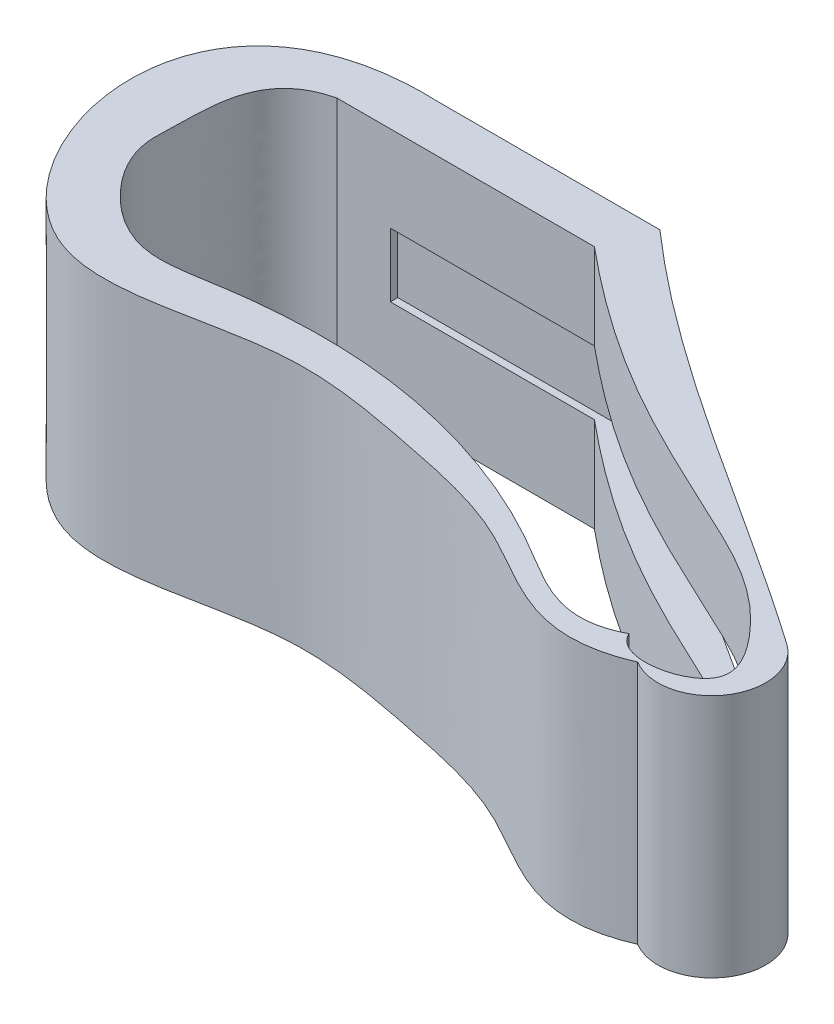
ISO-10303-21;
HEADER;
FILE_DESCRIPTION(('STEP AP214'),'2;1');
FILE_NAME('part.step','',(''),(''),'','','');
FILE_SCHEMA(('AUTOMOTIVE_DESIGN { 1 0 10303 214 1 1 1 1 }'));
ENDSEC;
DATA;
#1=APPLICATION_CONTEXT('core data for automotive mechanical design processes');
#2=APPLICATION_PROTOCOL_DEFINITION('international standard','automotive_design',2000,#1);
#3=PRODUCT_CONTEXT('',#1,'mechanical');
#4=PRODUCT('Part','Part','',(#3));
#5=PRODUCT_RELATED_PRODUCT_CATEGORY('part','',(#4));
#6=PRODUCT_DEFINITION_FORMATION('','',#4);
#7=PRODUCT_DEFINITION_CONTEXT('part definition',#1,'design');
#8=PRODUCT_DEFINITION('design','',#6,#7);
#9=PRODUCT_DEFINITION_SHAPE('','',#8);
#10=(LENGTH_UNIT() NAMED_UNIT(*) SI_UNIT(.MILLI.,.METRE.));
#11=(NAMED_UNIT(*) PLANE_ANGLE_UNIT() SI_UNIT($,.RADIAN.));
#12=(NAMED_UNIT(*) SI_UNIT($,.STERADIAN.) SOLID_ANGLE_UNIT());
#13=UNCERTAINTY_MEASURE_WITH_UNIT(LENGTH_MEASURE(1.E-05),#10,'distance_accuracy_value','');
#14=(GEOMETRIC_REPRESENTATION_CONTEXT(3) GLOBAL_UNCERTAINTY_ASSIGNED_CONTEXT((#13)) GLOBAL_UNIT_ASSIGNED_CONTEXT((#10,
#11,#12)) REPRESENTATION_CONTEXT('',''));
#15=CARTESIAN_POINT('',(0.,0.,0.));
#16=DIRECTION('',(0.,0.,1.));
#17=DIRECTION('',(1.,0.,0.));
#18=AXIS2_PLACEMENT_3D('',#15,#16,#17);
#19=CARTESIAN_POINT('',(50.,55.,0.));
#20=CARTESIAN_POINT('',(79.0245250397577,55.,25.5134937849484));
#21=CARTESIAN_POINT('',(113.333333333333,55.,44.2982456140352));
#22=CARTESIAN_POINT('',(145.,55.,66.4473684210526));
#23=B_SPLINE_CURVE_WITH_KNOTS('',3,(#19,#20,#21,#22),.UNSPECIFIED.,.F.,.F.,(4,4),(0.,1.),.UNSPECIFIED.);
#24=DIRECTION('',(0.,-1.,0.));
#25=VECTOR('',#24,1.);
#26=SURFACE_OF_LINEAR_EXTRUSION('',#23,#25);
#27=CARTESIAN_POINT('',(50.,0.,0.));
#28=CARTESIAN_POINT('',(79.0245250397577,0.,25.5134937849484));
#29=CARTESIAN_POINT('',(113.333333333333,0.,44.2982456140352));
#30=CARTESIAN_POINT('',(145.,0.,66.4473684210526));
#31=B_SPLINE_CURVE_WITH_KNOTS('',3,(#27,#28,#29,#30),.UNSPECIFIED.,.F.,.F.,(4,4),(0.,1.),.UNSPECIFIED.);
#32=CARTESIAN_POINT('',(50.,0.,0.));
#33=VERTEX_POINT('',#32);
#34=CARTESIAN_POINT('',(145.,0.,66.4473684210526));
#35=VERTEX_POINT('',#34);
#36=EDGE_CURVE('E300',#33,#35,#31,.T.);
#37=ORIENTED_EDGE('',*,*,#36,.F.);
#38=DIRECTION('',(0.,-1.,0.));
#39=VECTOR('',#38,1.);
#40=CARTESIAN_POINT('',(50.,55.,0.));
#41=LINE('',#40,#39);
#42=CARTESIAN_POINT('',(50.,55.,0.));
#43=VERTEX_POINT('',#42);
#44=EDGE_CURVE('E317',#43,#33,#41,.T.);
#45=ORIENTED_EDGE('',*,*,#44,.F.);
#46=CARTESIAN_POINT('',(145.,55.,66.4473684210526));
#47=VERTEX_POINT('',#46);
#48=EDGE_CURVE('E273',#43,#47,#23,.T.);
#49=ORIENTED_EDGE('',*,*,#48,.T.);
#50=DIRECTION('',(0.,-1.,0.));
#51=VECTOR('',#50,1.);
#52=CARTESIAN_POINT('',(145.,55.,66.4473684210526));
#53=LINE('',#52,#51);
#54=EDGE_CURVE('E315',#47,#35,#53,.T.);
#55=ORIENTED_EDGE('',*,*,#54,.T.);
#56=EDGE_LOOP('',(#37,#45,#49,#55));
#57=FACE_BOUND('',#56,.T.);
#58=CARTESIAN_POINT('',(50.,21.2909884969934,0.));
#59=CARTESIAN_POINT('',(79.0245250397577,21.2909884969934,25.5134937849484));
#60=CARTESIAN_POINT('',(113.333333333333,21.2909884969934,44.2982456140352));
#61=CARTESIAN_POINT('',(145.,21.2909884969934,66.4473684210526));
#62=B_SPLINE_CURVE_WITH_KNOTS('',3,(#58,#59,#60,#61),.UNSPECIFIED.,.F.,.F.,(4,4),(0.,1.),.UNSPECIFIED.);
#63=CARTESIAN_POINT('',(60.7614289056083,21.2909884969934,8.98967668737785));
#64=VERTEX_POINT('',#63);
#65=CARTESIAN_POINT('',(140.103841498925,21.2909884969934,63.0618556033218));
#66=VERTEX_POINT('',#65);
#67=EDGE_CURVE('E206',#64,#66,#62,.T.);
#68=ORIENTED_EDGE('',*,*,#67,.T.);
#69=DIRECTION('',(0.,-1.,0.));
#70=VECTOR('',#69,1.);
#71=CARTESIAN_POINT('',(140.103841498925,55.,63.0618556033217));
#72=LINE('',#71,#70);
#73=CARTESIAN_POINT('',(140.103841498925,35.664605677181,63.0618556033218));
#74=VERTEX_POINT('',#73);
#75=EDGE_CURVE('E218',#66,#74,#72,.F.);
#76=ORIENTED_EDGE('',*,*,#75,.T.);
#77=CARTESIAN_POINT('',(50.,35.664605677181,0.));
#78=CARTESIAN_POINT('',(79.0245250397577,35.664605677181,25.5134937849484));
#79=CARTESIAN_POINT('',(113.333333333333,35.664605677181,44.2982456140352));
#80=CARTESIAN_POINT('',(145.,35.664605677181,66.4473684210526));
#81=B_SPLINE_CURVE_WITH_KNOTS('',3,(#77,#78,#79,#80),.UNSPECIFIED.,.F.,.F.,(4,4),(0.,1.),.UNSPECIFIED.);
#82=CARTESIAN_POINT('',(60.7614289059177,35.664605677181,8.98967668762419));
#83=VERTEX_POINT('',#82);
#84=EDGE_CURVE('E190',#83,#74,#81,.T.);
#85=ORIENTED_EDGE('',*,*,#84,.F.);
#86=DIRECTION('',(0.,-1.,0.));
#87=VECTOR('',#86,1.);
#88=CARTESIAN_POINT('',(60.7614289056083,55.,8.98967668737785));
#89=LINE('',#88,#87);
#90=EDGE_CURVE('E11',#64,#83,#89,.F.);
#91=ORIENTED_EDGE('',*,*,#90,.F.);
#92=EDGE_LOOP('',(#68,#76,#85,#91));
#93=FACE_BOUND('',#92,.T.);
#94=ADVANCED_FACE('F37',(#57,#93),#26,.T.);
#95=CARTESIAN_POINT('',(45.9198185661056,69.,10.6538645582966));
#96=DIRECTION('',(0.,0.,1.));
#97=DIRECTION('',(1.,0.,0.));
#98=AXIS2_PLACEMENT_3D('',#95,#96,#97);
#99=PLANE('',#98);
#100=DIRECTION('',(0.,-1.,0.));
#101=VECTOR('',#100,1.);
#102=CARTESIAN_POINT('',(45.9198185661055,69.,10.6538645582966));
#103=LINE('',#102,#101);
#104=CARTESIAN_POINT('',(45.9198185661055,21.2909884969934,10.6538645582966));
#105=VERTEX_POINT('',#104);
#106=CARTESIAN_POINT('',(45.9198185661055,0.,10.6538645582966));
#107=VERTEX_POINT('',#106);
#108=EDGE_CURVE('E376',#105,#107,#103,.T.);
#109=ORIENTED_EDGE('',*,*,#108,.F.);
#110=DIRECTION('',(-1.,0.,0.));
#111=VECTOR('',#110,1.);
#112=CARTESIAN_POINT('',(45.9198185661056,21.2909884969934,10.6538645582966));
#113=LINE('',#112,#111);
#114=CARTESIAN_POINT('',(0.,21.2909884969934,10.6538645582966));
#115=VERTEX_POINT('',#114);
#116=EDGE_CURVE('E197',#105,#115,#113,.T.);
#117=ORIENTED_EDGE('',*,*,#116,.T.);
#118=DIRECTION('',(0.,1.,0.));
#119=VECTOR('',#118,1.);
#120=CARTESIAN_POINT('',(0.,69.,10.6538645582966));
#121=LINE('',#120,#119);
#122=CARTESIAN_POINT('',(0.,35.664605677181,10.6538645582966));
#123=VERTEX_POINT('',#122);
#124=EDGE_CURVE('E221',#115,#123,#121,.T.);
#125=ORIENTED_EDGE('',*,*,#124,.T.);
#126=DIRECTION('',(-1.,0.,0.));
#127=VECTOR('',#126,1.);
#128=CARTESIAN_POINT('',(45.9198185661056,35.664605677181,10.6538645582966));
#129=LINE('',#128,#127);
#130=CARTESIAN_POINT('',(45.9198185661055,35.664605677181,10.6538645582966));
#131=VERTEX_POINT('',#130);
#132=EDGE_CURVE('E184',#131,#123,#129,.T.);
#133=ORIENTED_EDGE('',*,*,#132,.F.);
#134=CARTESIAN_POINT('',(45.9198185661055,55.,10.6538645582966));
#135=VERTEX_POINT('',#134);
#136=EDGE_CURVE('E381',#135,#131,#103,.T.);
#137=ORIENTED_EDGE('',*,*,#136,.F.);
#138=DIRECTION('',(1.,0.,0.));
#139=VECTOR('',#138,1.);
#140=CARTESIAN_POINT('',(11.8218182295419,55.,10.6538645582966));
#141=LINE('',#140,#139);
#142=CARTESIAN_POINT('',(-11.9907204871083,55.,10.6538645582966));
#143=VERTEX_POINT('',#142);
#144=EDGE_CURVE('E408',#143,#135,#141,.T.);
#145=ORIENTED_EDGE('',*,*,#144,.F.);
#146=DIRECTION('',(0.,-1.,0.));
#147=VECTOR('',#146,1.);
#148=CARTESIAN_POINT('',(-11.9907204871083,69.,10.6538645582966));
#149=LINE('',#148,#147);
#150=CARTESIAN_POINT('',(-11.9907204871083,0.,10.6538645582966));
#151=VERTEX_POINT('',#150);
#152=EDGE_CURVE('E393',#143,#151,#149,.T.);
#153=ORIENTED_EDGE('',*,*,#152,.T.);
#154=DIRECTION('',(-1.,0.,0.));
#155=VECTOR('',#154,1.);
#156=CARTESIAN_POINT('',(45.9198185661056,0.,10.6538645582966));
#157=LINE('',#156,#155);
#158=EDGE_CURVE('E224',#107,#151,#157,.T.);
#159=ORIENTED_EDGE('',*,*,#158,.F.);
#160=EDGE_LOOP('',(#109,#117,#125,#133,#137,#145,#153,#159));
#161=FACE_BOUND('',#160,.T.);
#162=ADVANCED_FACE('F242',(#161),#99,.T.);
#163=CARTESIAN_POINT('',(-11.9907204871083,69.,10.6538645582966));
#164=CARTESIAN_POINT('',(-25.5960362402036,69.,13.8285071600395));
#165=CARTESIAN_POINT('',(-24.3693839179613,69.,27.6016775792646));
#166=CARTESIAN_POINT('',(-25.2041759688814,69.,43.5785634961515));
#167=CARTESIAN_POINT('',(-18.7717193506333,69.,54.4057587948836));
#168=CARTESIAN_POINT('',(-4.93842136242372,69.,63.6852957654707));
#169=CARTESIAN_POINT('',(16.8652741272833,69.,59.0849539313403));
#170=CARTESIAN_POINT('',(51.5892244408212,69.,57.3074758300545));
#171=CARTESIAN_POINT('',(90.5076644723297,69.,70.0717768823995));
#172=CARTESIAN_POINT('',(114.302121813737,69.,87.8333682441384));
#173=CARTESIAN_POINT('',(125.220110653523,69.,82.18080296494));
#174=B_SPLINE_CURVE_WITH_KNOTS('',3,(#163,#164,#165,#166,#167,#168,#169,#170,#171,#172,#173),
.UNSPECIFIED.,.F.,.F.,(4,1,1,1,1,1,1,1,4),(0.,0.142783015573018,0.159264519642799,
0.237664021420667,0.319036310464675,0.395894994651881,0.562922971471731,0.851387632545439,1.),.UNSPECIFIED.);
#175=DIRECTION('',(0.,-1.,0.));
#176=VECTOR('',#175,1.);
#177=SURFACE_OF_LINEAR_EXTRUSION('',#174,#176);
#178=DIRECTION('',(0.,-1.,0.));
#179=VECTOR('',#178,1.);
#180=CARTESIAN_POINT('',(125.220110653523,69.,82.18080296494));
#181=LINE('',#180,#179);
#182=CARTESIAN_POINT('',(125.220110653523,55.,82.1808029649401));
#183=VERTEX_POINT('',#182);
#184=CARTESIAN_POINT('',(125.220110653523,0.,82.18080296494));
#185=VERTEX_POINT('',#184);
#186=EDGE_CURVE('E385',#183,#185,#181,.T.);
#187=ORIENTED_EDGE('',*,*,#186,.T.);
#188=CARTESIAN_POINT('',(-11.9907204871083,0.,10.6538645582966));
#189=CARTESIAN_POINT('',(-25.5960362402036,0.,13.8285071600395));
#190=CARTESIAN_POINT('',(-24.3693839179613,0.,27.6016775792646));
#191=CARTESIAN_POINT('',(-25.2041759688814,0.,43.5785634961515));
#192=CARTESIAN_POINT('',(-18.7717193506333,0.,54.4057587948836));
#193=CARTESIAN_POINT('',(-4.93842136242372,0.,63.6852957654707));
#194=CARTESIAN_POINT('',(16.8652741272833,0.,59.0849539313403));
#195=CARTESIAN_POINT('',(51.5892244408212,0.,57.3074758300545));
#196=CARTESIAN_POINT('',(90.5076644723297,0.,70.0717768823995));
#197=CARTESIAN_POINT('',(114.302121813737,0.,87.8333682441384));
#198=CARTESIAN_POINT('',(125.220110653523,0.,82.18080296494));
#199=B_SPLINE_CURVE_WITH_KNOTS('',3,(#188,#189,#190,#191,#192,#193,#194,#195,#196,#197,#198),
.UNSPECIFIED.,.F.,.F.,(4,1,1,1,1,1,1,1,4),(0.,0.142783015573018,0.159264519642799,
0.237664021420667,0.319036310464675,0.395894994651881,0.562922971471731,0.851387632545439,1.),.UNSPECIFIED.);
#200=EDGE_CURVE('E386',#151,#185,#199,.T.);
#201=ORIENTED_EDGE('',*,*,#200,.F.);
#202=ORIENTED_EDGE('',*,*,#152,.F.);
#203=CARTESIAN_POINT('',(-11.9907204871083,55.,10.6538645582966));
#204=CARTESIAN_POINT('',(-25.5960362402036,55.,13.8285071600395));
#205=CARTESIAN_POINT('',(-24.3693839179613,55.,27.6016775792646));
#206=CARTESIAN_POINT('',(-25.2041759688814,55.,43.5785634961515));
#207=CARTESIAN_POINT('',(-18.7717193506333,55.,54.4057587948836));
#208=CARTESIAN_POINT('',(-4.93842136242372,55.,63.6852957654707));
#209=CARTESIAN_POINT('',(16.8652741272833,55.,59.0849539313403));
#210=CARTESIAN_POINT('',(51.5892244408212,55.,57.3074758300545));
#211=CARTESIAN_POINT('',(90.5076644723297,55.,70.0717768823995));
#212=CARTESIAN_POINT('',(114.302121813737,55.,87.8333682441384));
#213=CARTESIAN_POINT('',(125.220110653523,55.,82.18080296494));
#214=B_SPLINE_CURVE_WITH_KNOTS('',3,(#203,#204,#205,#206,#207,#208,#209,#210,#211,#212,#213),
.UNSPECIFIED.,.F.,.F.,(4,1,1,1,1,1,1,1,4),(0.,0.142783015573018,0.159264519642799,
0.237664021420667,0.319036310464675,0.395894994651881,0.562922971471731,0.851387632545439,1.),.UNSPECIFIED.);
#215=EDGE_CURVE('E400',#183,#143,#214,.F.);
#216=ORIENTED_EDGE('',*,*,#215,.F.);
#217=EDGE_LOOP('',(#187,#201,#202,#216));
#218=FACE_BOUND('',#217,.T.);
#219=CARTESIAN_POINT('',(-11.9907204871083,21.2909884969934,10.6538645582966));
#220=CARTESIAN_POINT('',(-25.5960362402036,21.2909884969934,13.8285071600395));
#221=CARTESIAN_POINT('',(-24.3693839179613,21.2909884969934,27.6016775792646));
#222=CARTESIAN_POINT('',(-25.2041759688814,21.2909884969934,43.5785634961515));
#223=CARTESIAN_POINT('',(-18.7717193506333,21.2909884969934,54.4057587948836));
#224=CARTESIAN_POINT('',(-4.93842136242372,21.2909884969934,63.6852957654707));
#225=CARTESIAN_POINT('',(16.8652741272833,21.2909884969934,59.0849539313403));
#226=CARTESIAN_POINT('',(51.5892244408212,21.2909884969934,57.3074758300545));
#227=CARTESIAN_POINT('',(90.5076644723297,21.2909884969934,70.0717768823995));
#228=CARTESIAN_POINT('',(114.302121813737,21.2909884969934,87.8333682441384));
#229=CARTESIAN_POINT('',(125.220110653523,21.2909884969934,82.18080296494));
#230=B_SPLINE_CURVE_WITH_KNOTS('',3,(#219,#220,#221,#222,#223,#224,#225,#226,#227,#228,#229),
.UNSPECIFIED.,.F.,.F.,(4,1,1,1,1,1,1,1,4),(0.,0.142783015573018,0.159264519642799,
0.237664021420667,0.319036310464675,0.395894994651881,0.562922971471731,0.851387632545439,1.),.UNSPECIFIED.);
#231=CARTESIAN_POINT('',(0.,21.2909884969934,61.9686026511814));
#232=VERTEX_POINT('',#231);
#233=CARTESIAN_POINT('',(65.1939779967523,21.2909884969934,63.0618556033218));
#234=VERTEX_POINT('',#233);
#235=EDGE_CURVE('E164',#232,#234,#230,.T.);
#236=ORIENTED_EDGE('',*,*,#235,.T.);
#237=DIRECTION('',(0.,-1.,0.));
#238=VECTOR('',#237,1.);
#239=CARTESIAN_POINT('',(65.1939779983709,27.5,63.0618556033218));
#240=LINE('',#239,#238);
#241=CARTESIAN_POINT('',(65.1939779967523,35.664605677181,63.0618556033218));
#242=VERTEX_POINT('',#241);
#243=EDGE_CURVE('E157',#234,#242,#240,.F.);
#244=ORIENTED_EDGE('',*,*,#243,.T.);
#245=CARTESIAN_POINT('',(-11.9907204871083,35.664605677181,10.6538645582966));
#246=CARTESIAN_POINT('',(-25.5960362402036,35.664605677181,13.8285071600395));
#247=CARTESIAN_POINT('',(-24.3693839179613,35.664605677181,27.6016775792646));
#248=CARTESIAN_POINT('',(-25.2041759688814,35.664605677181,43.5785634961515));
#249=CARTESIAN_POINT('',(-18.7717193506333,35.664605677181,54.4057587948836));
#250=CARTESIAN_POINT('',(-4.93842136242372,35.664605677181,63.6852957654707));
#251=CARTESIAN_POINT('',(16.8652741272833,35.664605677181,59.0849539313403));
#252=CARTESIAN_POINT('',(51.5892244408212,35.664605677181,57.3074758300545));
#253=CARTESIAN_POINT('',(90.5076644723297,35.664605677181,70.0717768823995));
#254=CARTESIAN_POINT('',(114.302121813737,35.664605677181,87.8333682441384));
#255=CARTESIAN_POINT('',(125.220110653523,35.664605677181,82.18080296494));
#256=B_SPLINE_CURVE_WITH_KNOTS('',3,(#245,#246,#247,#248,#249,#250,#251,#252,#253,#254,#255),
.UNSPECIFIED.,.F.,.F.,(4,1,1,1,1,1,1,1,4),(0.,0.142783015573018,0.159264519642799,
0.237664021420667,0.319036310464675,0.395894994651881,0.562922971471731,0.851387632545439,1.),.UNSPECIFIED.);
#257=CARTESIAN_POINT('',(0.,35.664605677181,61.9686026511814));
#258=VERTEX_POINT('',#257);
#259=EDGE_CURVE('E186',#258,#242,#256,.T.);
#260=ORIENTED_EDGE('',*,*,#259,.F.);
#261=DIRECTION('',(0.,-1.,0.));
#262=VECTOR('',#261,1.);
#263=CARTESIAN_POINT('',(0.,27.5,61.9686026511814));
#264=LINE('',#263,#262);
#265=EDGE_CURVE('E46',#258,#232,#264,.T.);
#266=ORIENTED_EDGE('',*,*,#265,.T.);
#267=EDGE_LOOP('',(#236,#244,#260,#266));
#268=FACE_BOUND('',#267,.T.);
#269=ADVANCED_FACE('F237',(#218,#268),#177,.T.);
#270=CARTESIAN_POINT('',(125.220110653523,69.,82.1808029649401));
#271=CARTESIAN_POINT('',(128.040973737857,69.,88.5495349270681));
#272=CARTESIAN_POINT('',(149.853952228594,69.,84.3702021922585));
#273=CARTESIAN_POINT('',(134.936663636845,69.,61.4112863937901));
#274=CARTESIAN_POINT('',(98.3416588067694,69.,43.7118445451393));
#275=CARTESIAN_POINT('',(72.4382320146535,69.,32.6536957633852));
#276=CARTESIAN_POINT('',(45.9198185661055,69.,10.6538645582966));
#277=B_SPLINE_CURVE_WITH_KNOTS('',3,(#270,#271,#272,#273,#274,#275,#276),.UNSPECIFIED.,.F.,.F.,
(4,1,1,1,4),(0.,0.144149385265527,0.22952118101207,0.450932314239249,1.),.UNSPECIFIED.);
#278=DIRECTION('',(0.,-1.,0.));
#279=VECTOR('',#278,1.);
#280=SURFACE_OF_LINEAR_EXTRUSION('',#277,#279);
#281=DIRECTION('',(0.,-1.,0.));
#282=VECTOR('',#281,1.);
#283=CARTESIAN_POINT('',(133.27516755912,27.5,63.0618556033218));
#284=LINE('',#283,#282);
#285=CARTESIAN_POINT('',(133.275167559116,35.664605677181,63.0618556033184));
#286=VERTEX_POINT('',#285);
#287=CARTESIAN_POINT('',(133.275167559116,21.2909884969934,63.0618556033218));
#288=VERTEX_POINT('',#287);
#289=EDGE_CURVE('E323',#286,#288,#284,.T.);
#290=ORIENTED_EDGE('',*,*,#289,.T.);
#291=CARTESIAN_POINT('',(125.220110653523,21.2909884969934,82.1808029649401));
#292=CARTESIAN_POINT('',(128.040973737857,21.2909884969934,88.5495349270681));
#293=CARTESIAN_POINT('',(149.853952228594,21.2909884969934,84.3702021922585));
#294=CARTESIAN_POINT('',(134.936663636845,21.2909884969934,61.4112863937901));
#295=CARTESIAN_POINT('',(98.3416588067694,21.2909884969934,43.7118445451393));
#296=CARTESIAN_POINT('',(72.4382320146535,21.2909884969934,32.6536957633852));
#297=CARTESIAN_POINT('',(45.9198185661055,21.2909884969934,10.6538645582966));
#298=B_SPLINE_CURVE_WITH_KNOTS('',3,(#291,#292,#293,#294,#295,#296,#297),.UNSPECIFIED.,.F.,.F.,
(4,1,1,1,4),(0.,0.144149385265527,0.22952118101207,0.450932314239249,1.),.UNSPECIFIED.);
#299=EDGE_CURVE('E329',#288,#105,#298,.T.);
#300=ORIENTED_EDGE('',*,*,#299,.T.);
#301=ORIENTED_EDGE('',*,*,#108,.T.);
#302=CARTESIAN_POINT('',(125.220110653523,0.,82.1808029649401));
#303=CARTESIAN_POINT('',(128.040973737857,0.,88.5495349270681));
#304=CARTESIAN_POINT('',(149.853952228594,0.,84.3702021922585));
#305=CARTESIAN_POINT('',(134.936663636845,0.,61.4112863937901));
#306=CARTESIAN_POINT('',(98.3416588067694,0.,43.7118445451393));
#307=CARTESIAN_POINT('',(72.4382320146535,0.,32.6536957633852));
#308=CARTESIAN_POINT('',(45.9198185661055,0.,10.6538645582966));
#309=B_SPLINE_CURVE_WITH_KNOTS('',3,(#302,#303,#304,#305,#306,#307,#308),.UNSPECIFIED.,.F.,.F.,
(4,1,1,1,4),(0.,0.144149385265527,0.22952118101207,0.450932314239249,1.),.UNSPECIFIED.);
#310=EDGE_CURVE('E382',#185,#107,#309,.T.);
#311=ORIENTED_EDGE('',*,*,#310,.F.);
#312=ORIENTED_EDGE('',*,*,#186,.F.);
#313=CARTESIAN_POINT('',(125.220110653523,55.,82.1808029649401));
#314=CARTESIAN_POINT('',(128.040973737857,55.,88.5495349270681));
#315=CARTESIAN_POINT('',(149.853952228594,55.,84.3702021922585));
#316=CARTESIAN_POINT('',(134.936663636845,55.,61.4112863937901));
#317=CARTESIAN_POINT('',(98.3416588067694,55.,43.7118445451393));
#318=CARTESIAN_POINT('',(72.4382320146535,55.,32.6536957633852));
#319=CARTESIAN_POINT('',(45.9198185661055,55.,10.6538645582966));
#320=B_SPLINE_CURVE_WITH_KNOTS('',3,(#313,#314,#315,#316,#317,#318,#319),.UNSPECIFIED.,.F.,.F.,
(4,1,1,1,4),(0.,0.144149385265527,0.22952118101207,0.450932314239249,1.),.UNSPECIFIED.);
#321=EDGE_CURVE('E395',#135,#183,#320,.F.);
#322=ORIENTED_EDGE('',*,*,#321,.F.);
#323=ORIENTED_EDGE('',*,*,#136,.T.);
#324=CARTESIAN_POINT('',(125.220110653523,35.664605677181,82.1808029649401));
#325=CARTESIAN_POINT('',(128.040973737857,35.664605677181,88.5495349270681));
#326=CARTESIAN_POINT('',(149.853952228594,35.664605677181,84.3702021922585));
#327=CARTESIAN_POINT('',(134.936663636845,35.664605677181,61.4112863937901));
#328=CARTESIAN_POINT('',(98.3416588067694,35.664605677181,43.7118445451393));
#329=CARTESIAN_POINT('',(72.4382320146535,35.664605677181,32.6536957633852));
#330=CARTESIAN_POINT('',(45.9198185661055,35.664605677181,10.6538645582966));
#331=B_SPLINE_CURVE_WITH_KNOTS('',3,(#324,#325,#326,#327,#328,#329,#330),.UNSPECIFIED.,.F.,.F.,
(4,1,1,1,4),(0.,0.144149385265527,0.22952118101207,0.450932314239249,1.),.UNSPECIFIED.);
#332=EDGE_CURVE('E314',#286,#131,#331,.T.);
#333=ORIENTED_EDGE('',*,*,#332,.F.);
#334=EDGE_LOOP('',(#290,#300,#301,#311,#312,#322,#323,#333));
#335=FACE_BOUND('',#334,.T.);
#336=ADVANCED_FACE('F241',(#335),#280,.T.);
#337=CARTESIAN_POINT('',(11.8218182295419,55.,70.3107839590311));
#338=DIRECTION('',(0.,1.,0.));
#339=DIRECTION('',(0.,0.,1.));
#340=AXIS2_PLACEMENT_3D('',#337,#338,#339);
#341=PLANE('',#340);
#342=CARTESIAN_POINT('',(131.743129045637,55.,86.7271704164046));
#343=CARTESIAN_POINT('',(113.423676908303,55.,94.6279430884531));
#344=CARTESIAN_POINT('',(95.6568496666579,55.,76.75529567226));
#345=CARTESIAN_POINT('',(61.7165811880212,55.,69.8800425328553));
#346=CARTESIAN_POINT('',(27.5339771578657,55.,63.3502340927568));
#347=CARTESIAN_POINT('',(-34.902240081503,55.,90.0696982033358));
#348=CARTESIAN_POINT('',(-56.8972414056911,55.,-2.24691320572262));
#349=CARTESIAN_POINT('',(0.,55.,0.));
#350=B_SPLINE_CURVE_WITH_KNOTS('',3,(#342,#343,#344,#345,#346,#347,#348,#349),.UNSPECIFIED.,.F.,
.F.,(4,1,1,1,1,4),(0.,0.177799360421137,0.292227638237178,0.41853661861666,0.610683723843843,
1.),.UNSPECIFIED.);
#351=CARTESIAN_POINT('',(131.743129045637,55.,86.7271704164046));
#352=VERTEX_POINT('',#351);
#353=CARTESIAN_POINT('',(0.,55.,0.));
#354=VERTEX_POINT('',#353);
#355=EDGE_CURVE('E311',#352,#354,#350,.T.);
#356=ORIENTED_EDGE('',*,*,#355,.F.);
#357=CARTESIAN_POINT('',(138.053235483287,55.,76.3791782845515));
#358=DIRECTION('',(0.,-1.,0.));
#359=DIRECTION('',(0.,0.,-1.));
#360=AXIS2_PLACEMENT_3D('',#357,#358,#359);
#361=CIRCLE('',#360,12.1201643724563);
#362=EDGE_CURVE('E280',#47,#352,#361,.T.);
#363=ORIENTED_EDGE('',*,*,#362,.F.);
#364=ORIENTED_EDGE('',*,*,#48,.F.);
#365=DIRECTION('',(1.,0.,0.));
#366=VECTOR('',#365,1.);
#367=CARTESIAN_POINT('',(0.,55.,0.));
#368=LINE('',#367,#366);
#369=EDGE_CURVE('E281',#354,#43,#368,.T.);
#370=ORIENTED_EDGE('',*,*,#369,.F.);
#371=EDGE_LOOP('',(#356,#363,#364,#370));
#372=FACE_BOUND('',#371,.T.);
#373=ORIENTED_EDGE('',*,*,#215,.T.);
#374=ORIENTED_EDGE('',*,*,#144,.T.);
#375=ORIENTED_EDGE('',*,*,#321,.T.);
#376=EDGE_LOOP('',(#373,#374,#375));
#377=FACE_BOUND('',#376,.T.);
#378=ADVANCED_FACE('F258',(#372,#377),#341,.T.);
#379=CARTESIAN_POINT('',(11.8218182295419,0.,70.3107839590311));
#380=DIRECTION('',(0.,1.,0.));
#381=DIRECTION('',(0.,0.,1.));
#382=AXIS2_PLACEMENT_3D('',#379,#380,#381);
#383=PLANE('',#382);
#384=CARTESIAN_POINT('',(131.743129045637,0.,86.7271704164046));
#385=CARTESIAN_POINT('',(113.423676908303,0.,94.6279430884531));
#386=CARTESIAN_POINT('',(95.6568496666579,0.,76.75529567226));
#387=CARTESIAN_POINT('',(61.7165811880212,0.,69.8800425328553));
#388=CARTESIAN_POINT('',(27.5339771578657,0.,63.3502340927568));
#389=CARTESIAN_POINT('',(-34.902240081503,0.,90.0696982033358));
#390=CARTESIAN_POINT('',(-56.8972414056911,0.,-2.24691320572262));
#391=CARTESIAN_POINT('',(0.,0.,0.));
#392=B_SPLINE_CURVE_WITH_KNOTS('',3,(#384,#385,#386,#387,#388,#389,#390,#391),.UNSPECIFIED.,.F.,
.F.,(4,1,1,1,1,4),(0.,0.177799360421137,0.292227638237178,0.41853661861666,0.610683723843843,
1.),.UNSPECIFIED.);
#393=CARTESIAN_POINT('',(131.743129045637,0.,86.7271704164046));
#394=VERTEX_POINT('',#393);
#395=CARTESIAN_POINT('',(0.,0.,0.));
#396=VERTEX_POINT('',#395);
#397=EDGE_CURVE('E288',#394,#396,#392,.T.);
#398=ORIENTED_EDGE('',*,*,#397,.T.);
#399=DIRECTION('',(1.,0.,0.));
#400=VECTOR('',#399,1.);
#401=CARTESIAN_POINT('',(0.,0.,0.));
#402=LINE('',#401,#400);
#403=EDGE_CURVE('E293',#396,#33,#402,.T.);
#404=ORIENTED_EDGE('',*,*,#403,.T.);
#405=ORIENTED_EDGE('',*,*,#36,.T.);
#406=CARTESIAN_POINT('',(138.053235483287,0.,76.3791782845515));
#407=DIRECTION('',(0.,-1.,0.));
#408=DIRECTION('',(0.,0.,-1.));
#409=AXIS2_PLACEMENT_3D('',#406,#407,#408);
#410=CIRCLE('',#409,12.1201643724563);
#411=EDGE_CURVE('E305',#35,#394,#410,.T.);
#412=ORIENTED_EDGE('',*,*,#411,.T.);
#413=EDGE_LOOP('',(#398,#404,#405,#412));
#414=FACE_BOUND('',#413,.T.);
#415=ORIENTED_EDGE('',*,*,#158,.T.);
#416=ORIENTED_EDGE('',*,*,#200,.T.);
#417=ORIENTED_EDGE('',*,*,#310,.T.);
#418=EDGE_LOOP('',(#415,#416,#417));
#419=FACE_BOUND('',#418,.T.);
#420=ADVANCED_FACE('F261',(#414,#419),#383,.F.);
#421=DIRECTION('',(0.,-1.,0.));
#422=VECTOR('',#421,1.);
#423=SURFACE_OF_LINEAR_EXTRUSION('',#350,#422);
#424=ORIENTED_EDGE('',*,*,#397,.F.);
#425=DIRECTION('',(0.,-1.,0.));
#426=VECTOR('',#425,1.);
#427=CARTESIAN_POINT('',(131.743129045637,55.,86.7271704164046));
#428=LINE('',#427,#426);
#429=EDGE_CURVE('E312',#352,#394,#428,.T.);
#430=ORIENTED_EDGE('',*,*,#429,.F.);
#431=ORIENTED_EDGE('',*,*,#355,.T.);
#432=DIRECTION('',(0.,-1.,0.));
#433=VECTOR('',#432,1.);
#434=CARTESIAN_POINT('',(0.,55.,0.));
#435=LINE('',#434,#433);
#436=EDGE_CURVE('E287',#354,#396,#435,.T.);
#437=ORIENTED_EDGE('',*,*,#436,.T.);
#438=EDGE_LOOP('',(#424,#430,#431,#437));
#439=FACE_BOUND('',#438,.T.);
#440=ADVANCED_FACE('F39',(#439),#423,.T.);
#441=CARTESIAN_POINT('',(138.053235483287,55.,76.3791782845515));
#442=DIRECTION('',(0.,-1.,0.));
#443=DIRECTION('',(0.,0.,-1.));
#444=AXIS2_PLACEMENT_3D('',#441,#442,#443);
#445=CYLINDRICAL_SURFACE('',#444,12.1201643724563);
#446=ORIENTED_EDGE('',*,*,#411,.F.);
#447=ORIENTED_EDGE('',*,*,#54,.F.);
#448=ORIENTED_EDGE('',*,*,#362,.T.);
#449=ORIENTED_EDGE('',*,*,#429,.T.);
#450=EDGE_LOOP('',(#446,#447,#448,#449));
#451=FACE_BOUND('',#450,.T.);
#452=ADVANCED_FACE('F266',(#451),#445,.T.);
#453=CARTESIAN_POINT('',(0.,55.,0.));
#454=DIRECTION('',(0.,0.,-1.));
#455=DIRECTION('',(-1.,0.,0.));
#456=AXIS2_PLACEMENT_3D('',#453,#454,#455);
#457=PLANE('',#456);
#458=CARTESIAN_POINT('',(25.,27.5,0.));
#459=DIRECTION('',(0.,0.,-1.));
#460=DIRECTION('',(-1.,0.,0.));
#461=AXIS2_PLACEMENT_3D('',#458,#459,#460);
#462=CIRCLE('',#461,5.);
#463=CARTESIAN_POINT('',(20.,27.5,0.));
#464=VERTEX_POINT('',#463);
#465=EDGE_CURVE('E414',#464,#464,#462,.T.);
#466=ORIENTED_EDGE('',*,*,#465,.F.);
#467=EDGE_LOOP('',(#466));
#468=FACE_BOUND('',#467,.T.);
#469=ORIENTED_EDGE('',*,*,#403,.F.);
#470=ORIENTED_EDGE('',*,*,#436,.F.);
#471=ORIENTED_EDGE('',*,*,#369,.T.);
#472=ORIENTED_EDGE('',*,*,#44,.T.);
#473=EDGE_LOOP('',(#469,#470,#471,#472));
#474=FACE_BOUND('',#473,.T.);
#475=ADVANCED_FACE('F256',(#468,#474),#457,.T.);
#476=CARTESIAN_POINT('',(25.,27.5,7.));
#477=DIRECTION('',(0.,0.,-1.));
#478=DIRECTION('',(-1.,0.,0.));
#479=AXIS2_PLACEMENT_3D('',#476,#477,#478);
#480=CYLINDRICAL_SURFACE('',#479,5.);
#481=CARTESIAN_POINT('',(25.,27.5,7.));
#482=DIRECTION('',(0.,0.,-1.));
#483=DIRECTION('',(-1.,0.,0.));
#484=AXIS2_PLACEMENT_3D('',#481,#482,#483);
#485=CIRCLE('',#484,5.);
#486=CARTESIAN_POINT('',(20.,27.5,7.));
#487=VERTEX_POINT('',#486);
#488=EDGE_CURVE('E294',#487,#487,#485,.T.);
#489=ORIENTED_EDGE('',*,*,#488,.F.);
#490=EDGE_LOOP('',(#489));
#491=FACE_BOUND('',#490,.T.);
#492=ORIENTED_EDGE('',*,*,#465,.T.);
#493=EDGE_LOOP('',(#492));
#494=FACE_BOUND('',#493,.T.);
#495=ADVANCED_FACE('F252',(#491,#494),#480,.F.);
#496=CARTESIAN_POINT('',(25.,27.5,7.));
#497=DIRECTION('',(0.,0.,-1.));
#498=DIRECTION('',(-1.,0.,0.));
#499=AXIS2_PLACEMENT_3D('',#496,#497,#498);
#500=PLANE('',#499);
#501=ORIENTED_EDGE('',*,*,#488,.T.);
#502=EDGE_LOOP('',(#501));
#503=FACE_BOUND('',#502,.T.);
#504=ADVANCED_FACE('F248',(#503),#500,.T.);
#505=CARTESIAN_POINT('',(144.,35.664605677181,63.0618556033218));
#506=DIRECTION('',(0.,1.,0.));
#507=DIRECTION('',(0.,0.,1.));
#508=AXIS2_PLACEMENT_3D('',#505,#506,#507);
#509=PLANE('',#508);
#510=ORIENTED_EDGE('',*,*,#84,.T.);
#511=DIRECTION('',(-1.,0.,0.));
#512=VECTOR('',#511,1.);
#513=CARTESIAN_POINT('',(144.,35.664605677181,63.0618556033218));
#514=LINE('',#513,#512);
#515=EDGE_CURVE('E181',#74,#286,#514,.T.);
#516=ORIENTED_EDGE('',*,*,#515,.T.);
#517=ORIENTED_EDGE('',*,*,#332,.T.);
#518=ORIENTED_EDGE('',*,*,#132,.T.);
#519=DIRECTION('',(0.,0.,-1.));
#520=VECTOR('',#519,1.);
#521=CARTESIAN_POINT('',(0.,35.664605677181,63.0618556033218));
#522=LINE('',#521,#520);
#523=CARTESIAN_POINT('',(0.,35.664605677181,8.98967668737785));
#524=VERTEX_POINT('',#523);
#525=EDGE_CURVE('E177',#123,#524,#522,.T.);
#526=ORIENTED_EDGE('',*,*,#525,.T.);
#527=DIRECTION('',(-1.,0.,0.));
#528=VECTOR('',#527,1.);
#529=CARTESIAN_POINT('',(144.,35.664605677181,8.98967668737785));
#530=LINE('',#529,#528);
#531=EDGE_CURVE('E53',#83,#524,#530,.T.);
#532=ORIENTED_EDGE('',*,*,#531,.F.);
#533=EDGE_LOOP('',(#510,#516,#517,#518,#526,#532));
#534=FACE_BOUND('',#533,.T.);
#535=ADVANCED_FACE('F251',(#534),#509,.F.);
#536=CARTESIAN_POINT('',(144.,21.2909884969934,63.0618556033218));
#537=DIRECTION('',(0.,1.,0.));
#538=DIRECTION('',(0.,0.,1.));
#539=AXIS2_PLACEMENT_3D('',#536,#537,#538);
#540=PLANE('',#539);
#541=DIRECTION('',(-1.,0.,0.));
#542=VECTOR('',#541,1.);
#543=CARTESIAN_POINT('',(144.,21.2909884969934,8.98967668737785));
#544=LINE('',#543,#542);
#545=CARTESIAN_POINT('',(0.,21.2909884969934,8.98967668737785));
#546=VERTEX_POINT('',#545);
#547=EDGE_CURVE('E161',#64,#546,#544,.T.);
#548=ORIENTED_EDGE('',*,*,#547,.T.);
#549=DIRECTION('',(0.,0.,-1.));
#550=VECTOR('',#549,1.);
#551=CARTESIAN_POINT('',(0.,21.2909884969934,63.0618556033218));
#552=LINE('',#551,#550);
#553=EDGE_CURVE('E167',#115,#546,#552,.T.);
#554=ORIENTED_EDGE('',*,*,#553,.F.);
#555=ORIENTED_EDGE('',*,*,#116,.F.);
#556=ORIENTED_EDGE('',*,*,#299,.F.);
#557=DIRECTION('',(-1.,0.,0.));
#558=VECTOR('',#557,1.);
#559=CARTESIAN_POINT('',(144.,21.2909884969934,63.0618556033218));
#560=LINE('',#559,#558);
#561=EDGE_CURVE('E160',#66,#288,#560,.T.);
#562=ORIENTED_EDGE('',*,*,#561,.F.);
#563=ORIENTED_EDGE('',*,*,#67,.F.);
#564=EDGE_LOOP('',(#548,#554,#555,#556,#562,#563));
#565=FACE_BOUND('',#564,.T.);
#566=ADVANCED_FACE('F349',(#565),#540,.T.);
#567=CARTESIAN_POINT('',(144.,35.664605677181,63.0618556033218));
#568=DIRECTION('',(0.,0.,-1.));
#569=DIRECTION('',(-1.,0.,0.));
#570=AXIS2_PLACEMENT_3D('',#567,#568,#569);
#571=PLANE('',#570);
#572=ORIENTED_EDGE('',*,*,#561,.T.);
#573=ORIENTED_EDGE('',*,*,#289,.F.);
#574=ORIENTED_EDGE('',*,*,#515,.F.);
#575=ORIENTED_EDGE('',*,*,#75,.F.);
#576=EDGE_LOOP('',(#572,#573,#574,#575));
#577=FACE_BOUND('',#576,.T.);
#578=ADVANCED_FACE('F355',(#577),#571,.T.);
#579=CARTESIAN_POINT('',(0.,0.,0.));
#580=DIRECTION('',(1.,0.,0.));
#581=DIRECTION('',(0.,0.,-1.));
#582=AXIS2_PLACEMENT_3D('',#579,#580,#581);
#583=PLANE('',#582);
#584=ORIENTED_EDGE('',*,*,#553,.T.);
#585=DIRECTION('',(0.,-1.,0.));
#586=VECTOR('',#585,1.);
#587=CARTESIAN_POINT('',(0.,35.664605677181,8.98967668737785));
#588=LINE('',#587,#586);
#589=EDGE_CURVE('E166',#524,#546,#588,.T.);
#590=ORIENTED_EDGE('',*,*,#589,.F.);
#591=ORIENTED_EDGE('',*,*,#525,.F.);
#592=ORIENTED_EDGE('',*,*,#124,.F.);
#593=EDGE_LOOP('',(#584,#590,#591,#592));
#594=FACE_BOUND('',#593,.T.);
#595=ADVANCED_FACE('F347',(#594),#583,.T.);
#596=CARTESIAN_POINT('',(144.,35.664605677181,8.98967668737785));
#597=DIRECTION('',(0.,0.,-1.));
#598=DIRECTION('',(-1.,0.,0.));
#599=AXIS2_PLACEMENT_3D('',#596,#597,#598);
#600=PLANE('',#599);
#601=ORIENTED_EDGE('',*,*,#90,.T.);
#602=ORIENTED_EDGE('',*,*,#531,.T.);
#603=ORIENTED_EDGE('',*,*,#589,.T.);
#604=ORIENTED_EDGE('',*,*,#547,.F.);
#605=EDGE_LOOP('',(#601,#602,#603,#604));
#606=FACE_BOUND('',#605,.T.);
#607=ADVANCED_FACE('F369',(#606),#600,.F.);
#608=CARTESIAN_POINT('',(0.,21.2909884969934,63.0618556033218));
#609=VERTEX_POINT('',#608);
#610=EDGE_CURVE('E151',#234,#609,#560,.T.);
#611=ORIENTED_EDGE('',*,*,#610,.T.);
#612=DIRECTION('',(0.,-1.,0.));
#613=VECTOR('',#612,1.);
#614=CARTESIAN_POINT('',(0.,35.664605677181,63.0618556033218));
#615=LINE('',#614,#613);
#616=CARTESIAN_POINT('',(0.,35.664605677181,63.0618556033218));
#617=VERTEX_POINT('',#616);
#618=EDGE_CURVE('E154',#617,#609,#615,.T.);
#619=ORIENTED_EDGE('',*,*,#618,.F.);
#620=EDGE_CURVE('E179',#242,#617,#514,.T.);
#621=ORIENTED_EDGE('',*,*,#620,.F.);
#622=ORIENTED_EDGE('',*,*,#243,.F.);
#623=EDGE_LOOP('',(#611,#619,#621,#622));
#624=FACE_BOUND('',#623,.T.);
#625=ADVANCED_FACE('F152',(#624),#571,.T.);
#626=EDGE_CURVE('E60',#609,#232,#552,.T.);
#627=ORIENTED_EDGE('',*,*,#626,.F.);
#628=ORIENTED_EDGE('',*,*,#610,.F.);
#629=ORIENTED_EDGE('',*,*,#235,.F.);
#630=EDGE_LOOP('',(#627,#628,#629));
#631=FACE_BOUND('',#630,.T.);
#632=ADVANCED_FACE('F163',(#631),#540,.T.);
#633=ORIENTED_EDGE('',*,*,#259,.T.);
#634=ORIENTED_EDGE('',*,*,#620,.T.);
#635=EDGE_CURVE('E171',#617,#258,#522,.T.);
#636=ORIENTED_EDGE('',*,*,#635,.T.);
#637=EDGE_LOOP('',(#633,#634,#636));
#638=FACE_BOUND('',#637,.T.);
#639=ADVANCED_FACE('F339',(#638),#509,.F.);
#640=ORIENTED_EDGE('',*,*,#635,.F.);
#641=ORIENTED_EDGE('',*,*,#618,.T.);
#642=ORIENTED_EDGE('',*,*,#626,.T.);
#643=ORIENTED_EDGE('',*,*,#265,.F.);
#644=EDGE_LOOP('',(#640,#641,#642,#643));
#645=FACE_BOUND('',#644,.T.);
#646=ADVANCED_FACE('F169',(#645),#583,.T.);
#647=CLOSED_SHELL('',(#94,#162,#269,#336,#378,#420,#440,#452,#475,#495,#504,#535,#566,#578,#595,
#607,#625,#632,#639,#646));
#648=MANIFOLD_SOLID_BREP('B2',#647);
#649=ADVANCED_BREP_SHAPE_REPRESENTATION('',(#18,#648),#14);
#650=SHAPE_DEFINITION_REPRESENTATION(#9,#649);
ENDSEC;
END-ISO-10303-21;
